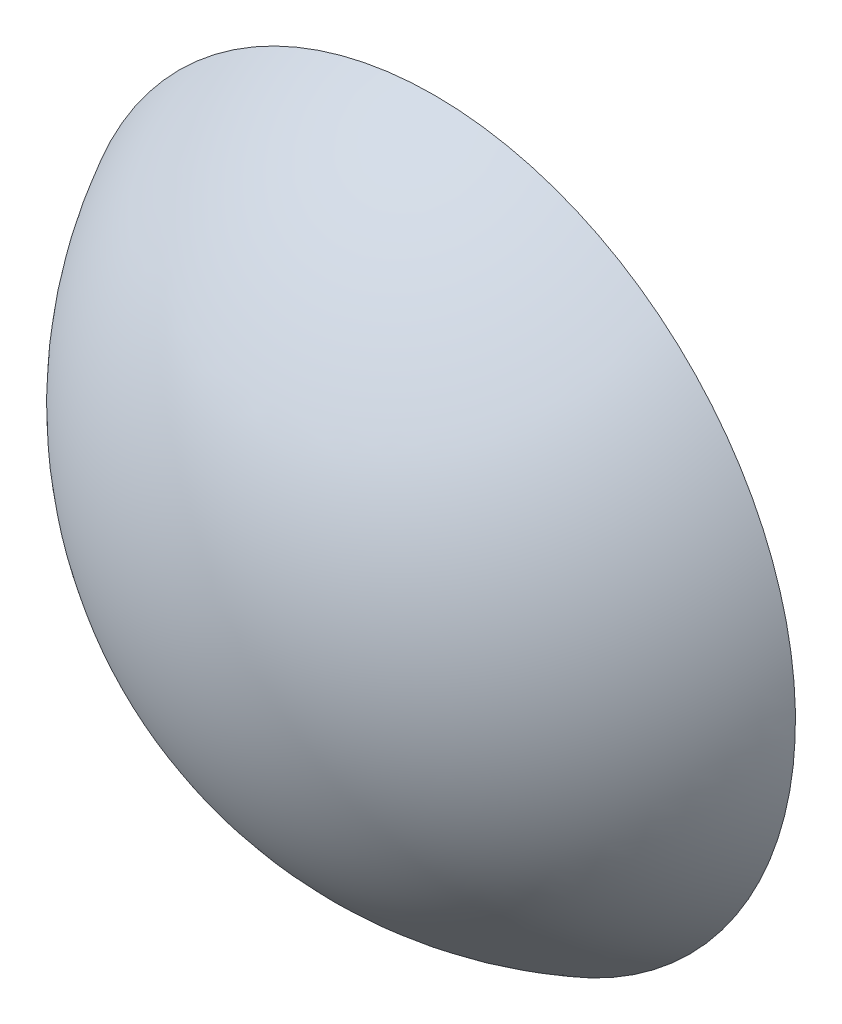
ISO-10303-21;
HEADER;
FILE_DESCRIPTION(('STEP AP214'),'2;1');
FILE_NAME('part.step','',(''),(''),'','','');
FILE_SCHEMA(('AUTOMOTIVE_DESIGN { 1 0 10303 214 1 1 1 1 }'));
ENDSEC;
DATA;
#1=APPLICATION_CONTEXT('core data for automotive mechanical design processes');
#2=APPLICATION_PROTOCOL_DEFINITION('international standard','automotive_design',2000,#1);
#3=PRODUCT_CONTEXT('',#1,'mechanical');
#4=PRODUCT('Part','Part','',(#3));
#5=PRODUCT_RELATED_PRODUCT_CATEGORY('part','',(#4));
#6=PRODUCT_DEFINITION_FORMATION('','',#4);
#7=PRODUCT_DEFINITION_CONTEXT('part definition',#1,'design');
#8=PRODUCT_DEFINITION('design','',#6,#7);
#9=PRODUCT_DEFINITION_SHAPE('','',#8);
#10=(LENGTH_UNIT() NAMED_UNIT(*) SI_UNIT(.MILLI.,.METRE.));
#11=(NAMED_UNIT(*) PLANE_ANGLE_UNIT() SI_UNIT($,.RADIAN.));
#12=(NAMED_UNIT(*) SI_UNIT($,.STERADIAN.) SOLID_ANGLE_UNIT());
#13=UNCERTAINTY_MEASURE_WITH_UNIT(LENGTH_MEASURE(1.E-05),#10,'distance_accuracy_value','');
#14=(GEOMETRIC_REPRESENTATION_CONTEXT(3) GLOBAL_UNCERTAINTY_ASSIGNED_CONTEXT((#13)) GLOBAL_UNIT_ASSIGNED_CONTEXT((#10,
#11,#12)) REPRESENTATION_CONTEXT('',''));
#15=CARTESIAN_POINT('',(0.,0.,0.));
#16=DIRECTION('',(0.,0.,1.));
#17=DIRECTION('',(1.,0.,0.));
#18=AXIS2_PLACEMENT_3D('',#15,#16,#17);
#19=CARTESIAN_POINT('',(0.,0.,0.));
#20=DIRECTION('',(0.,0.,-1.));
#21=DIRECTION('',(0.,1.,0.));
#22=AXIS2_PLACEMENT_3D('',#19,#20,#21);
#23=SPHERICAL_SURFACE('',#22,9.525);
#24=CARTESIAN_POINT('',(0.,0.,4.38192426453627));
#25=DIRECTION('',(0.,0.,-1.));
#26=DIRECTION('',(-1.,0.,0.));
#27=AXIS2_PLACEMENT_3D('',#24,#25,#26);
#28=CIRCLE('',#27,8.45720785719898);
#29=CARTESIAN_POINT('',(-8.45720785719898,0.,4.38192426453627));
#30=VERTEX_POINT('',#29);
#31=EDGE_CURVE('E10',#30,#30,#28,.T.);
#32=ORIENTED_EDGE('',*,*,#31,.F.);
#33=EDGE_LOOP('',(#32));
#34=FACE_BOUND('',#33,.T.);
#35=ADVANCED_FACE('F43',(#34),#23,.T.);
#36=CARTESIAN_POINT('',(0.,0.,4.38192426453627));
#37=DIRECTION('',(0.,0.,-1.));
#38=DIRECTION('',(-1.,0.,0.));
#39=AXIS2_PLACEMENT_3D('',#36,#37,#38);
#40=PLANE('',#39);
#41=ORIENTED_EDGE('',*,*,#31,.T.);
#42=EDGE_LOOP('',(#41));
#43=FACE_BOUND('',#42,.T.);
#44=ADVANCED_FACE('F51',(#43),#40,.T.);
#45=CLOSED_SHELL('',(#35,#44));
#46=MANIFOLD_SOLID_BREP('B2',#45);
#47=ADVANCED_BREP_SHAPE_REPRESENTATION('',(#18,#46),#14);
#48=SHAPE_DEFINITION_REPRESENTATION(#9,#47);
ENDSEC;
END-ISO-10303-21;
